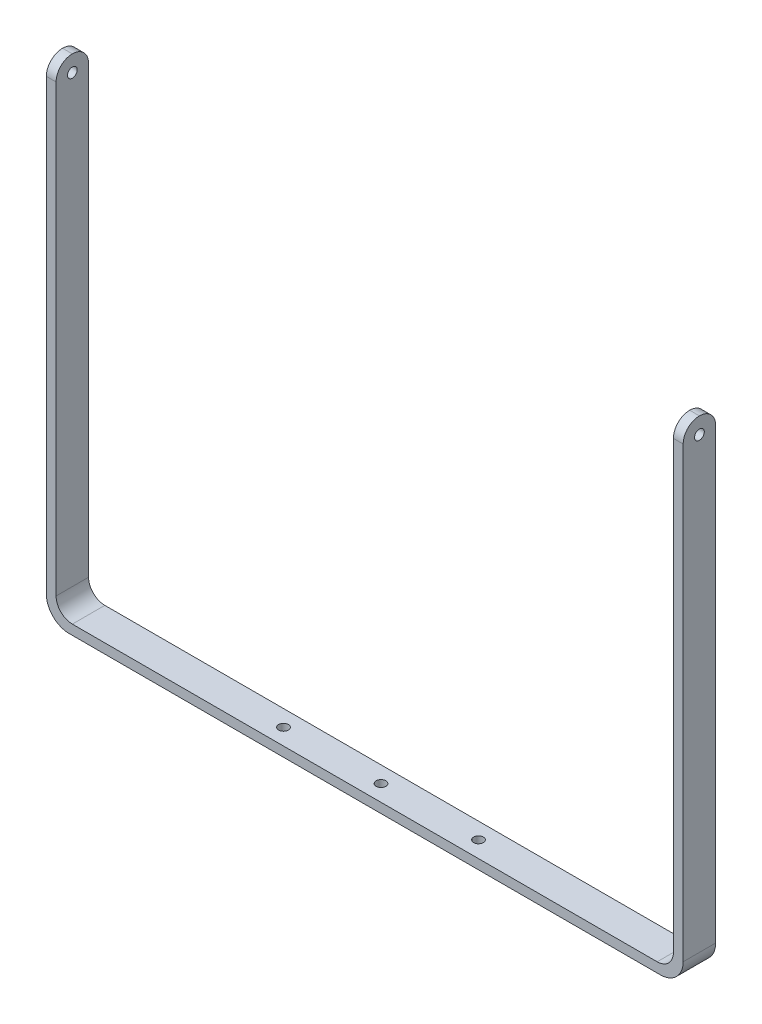
ISO-10303-21;
HEADER;
FILE_DESCRIPTION(('STEP AP214'),'2;1');
FILE_NAME('part.step','',(''),(''),'','','');
FILE_SCHEMA(('AUTOMOTIVE_DESIGN { 1 0 10303 214 1 1 1 1 }'));
ENDSEC;
DATA;
#1=APPLICATION_CONTEXT('core data for automotive mechanical design processes');
#2=APPLICATION_PROTOCOL_DEFINITION('international standard','automotive_design',2000,#1);
#3=PRODUCT_CONTEXT('',#1,'mechanical');
#4=PRODUCT('Part','Part','',(#3));
#5=PRODUCT_RELATED_PRODUCT_CATEGORY('part','',(#4));
#6=PRODUCT_DEFINITION_FORMATION('','',#4);
#7=PRODUCT_DEFINITION_CONTEXT('part definition',#1,'design');
#8=PRODUCT_DEFINITION('design','',#6,#7);
#9=PRODUCT_DEFINITION_SHAPE('','',#8);
#10=(LENGTH_UNIT() NAMED_UNIT(*) SI_UNIT(.MILLI.,.METRE.));
#11=(NAMED_UNIT(*) PLANE_ANGLE_UNIT() SI_UNIT($,.RADIAN.));
#12=(NAMED_UNIT(*) SI_UNIT($,.STERADIAN.) SOLID_ANGLE_UNIT());
#13=UNCERTAINTY_MEASURE_WITH_UNIT(LENGTH_MEASURE(1.E-05),#10,'distance_accuracy_value','');
#14=(GEOMETRIC_REPRESENTATION_CONTEXT(3) GLOBAL_UNCERTAINTY_ASSIGNED_CONTEXT((#13)) GLOBAL_UNIT_ASSIGNED_CONTEXT((#10,
#11,#12)) REPRESENTATION_CONTEXT('',''));
#15=CARTESIAN_POINT('',(0.,0.,0.));
#16=DIRECTION('',(0.,0.,1.));
#17=DIRECTION('',(1.,0.,0.));
#18=AXIS2_PLACEMENT_3D('',#15,#16,#17);
#19=CARTESIAN_POINT('',(-98.,75.,10.));
#20=DIRECTION('',(1.,0.,0.));
#21=DIRECTION('',(0.,0.,-1.));
#22=AXIS2_PLACEMENT_3D('',#19,#20,#21);
#23=PLANE('',#22);
#24=CARTESIAN_POINT('',(-98.,70.,5.));
#25=DIRECTION('',(-1.,0.,0.));
#26=DIRECTION('',(0.,0.,1.));
#27=AXIS2_PLACEMENT_3D('',#24,#25,#26);
#28=CIRCLE('',#27,1.5);
#29=CARTESIAN_POINT('',(-98.,70.,6.5));
#30=VERTEX_POINT('',#29);
#31=EDGE_CURVE('E484',#30,#30,#28,.T.);
#32=ORIENTED_EDGE('',*,*,#31,.F.);
#33=EDGE_LOOP('',(#32));
#34=FACE_BOUND('',#33,.T.);
#35=DIRECTION('',(0.,-1.,0.));
#36=VECTOR('',#35,1.);
#37=CARTESIAN_POINT('',(-98.,75.,0.));
#38=LINE('',#37,#36);
#39=CARTESIAN_POINT('',(-98.,70.,0.));
#40=VERTEX_POINT('',#39);
#41=CARTESIAN_POINT('',(-98.,-68.,0.));
#42=VERTEX_POINT('',#41);
#43=EDGE_CURVE('E200',#40,#42,#38,.T.);
#44=ORIENTED_EDGE('',*,*,#43,.T.);
#45=DIRECTION('',(0.,0.,-1.));
#46=VECTOR('',#45,1.);
#47=CARTESIAN_POINT('',(-98.,-68.,10.));
#48=LINE('',#47,#46);
#49=CARTESIAN_POINT('',(-98.,-68.,10.));
#50=VERTEX_POINT('',#49);
#51=EDGE_CURVE('E45',#42,#50,#48,.F.);
#52=ORIENTED_EDGE('',*,*,#51,.T.);
#53=DIRECTION('',(0.,-1.,0.));
#54=VECTOR('',#53,1.);
#55=CARTESIAN_POINT('',(-98.,75.,10.));
#56=LINE('',#55,#54);
#57=CARTESIAN_POINT('',(-98.,70.,10.));
#58=VERTEX_POINT('',#57);
#59=EDGE_CURVE('E254',#58,#50,#56,.T.);
#60=ORIENTED_EDGE('',*,*,#59,.F.);
#61=CARTESIAN_POINT('',(-98.,70.,5.));
#62=DIRECTION('',(1.,0.,0.));
#63=DIRECTION('',(0.,0.,-1.));
#64=AXIS2_PLACEMENT_3D('',#61,#62,#63);
#65=CIRCLE('',#64,5.);
#66=CARTESIAN_POINT('',(-98.,75.,5.));
#67=VERTEX_POINT('',#66);
#68=EDGE_CURVE('E182',#58,#67,#65,.F.);
#69=ORIENTED_EDGE('',*,*,#68,.T.);
#70=CARTESIAN_POINT('',(-98.,70.,5.));
#71=DIRECTION('',(1.,0.,0.));
#72=DIRECTION('',(0.,0.,-1.));
#73=AXIS2_PLACEMENT_3D('',#70,#71,#72);
#74=CIRCLE('',#73,5.);
#75=EDGE_CURVE('E184',#67,#40,#74,.F.);
#76=ORIENTED_EDGE('',*,*,#75,.T.);
#77=EDGE_LOOP('',(#44,#52,#60,#69,#76));
#78=FACE_BOUND('',#77,.T.);
#79=ADVANCED_FACE('F36',(#34,#78),#23,.F.);
#80=CARTESIAN_POINT('',(-98.,-75.,10.));
#81=DIRECTION('',(0.,1.,0.));
#82=DIRECTION('',(-1.,0.,0.));
#83=AXIS2_PLACEMENT_3D('',#80,#81,#82);
#84=PLANE('',#83);
#85=CARTESIAN_POINT('',(30.,-75.,5.));
#86=DIRECTION('',(0.,1.,0.));
#87=DIRECTION('',(-1.,0.,0.));
#88=AXIS2_PLACEMENT_3D('',#85,#86,#87);
#89=CIRCLE('',#88,1.5);
#90=CARTESIAN_POINT('',(28.5,-75.,5.));
#91=VERTEX_POINT('',#90);
#92=EDGE_CURVE('E483',#91,#91,#89,.T.);
#93=ORIENTED_EDGE('',*,*,#92,.T.);
#94=EDGE_LOOP('',(#93));
#95=FACE_BOUND('',#94,.T.);
#96=CARTESIAN_POINT('',(-30.,-75.,5.));
#97=DIRECTION('',(0.,1.,0.));
#98=DIRECTION('',(-1.,0.,0.));
#99=AXIS2_PLACEMENT_3D('',#96,#97,#98);
#100=CIRCLE('',#99,1.5);
#101=CARTESIAN_POINT('',(-31.5,-75.,5.));
#102=VERTEX_POINT('',#101);
#103=EDGE_CURVE('E485',#102,#102,#100,.T.);
#104=ORIENTED_EDGE('',*,*,#103,.T.);
#105=EDGE_LOOP('',(#104));
#106=FACE_BOUND('',#105,.T.);
#107=CARTESIAN_POINT('',(0.,-75.,5.));
#108=DIRECTION('',(0.,1.,0.));
#109=DIRECTION('',(-1.,0.,0.));
#110=AXIS2_PLACEMENT_3D('',#107,#108,#109);
#111=CIRCLE('',#110,1.5);
#112=CARTESIAN_POINT('',(-1.5,-75.,5.));
#113=VERTEX_POINT('',#112);
#114=EDGE_CURVE('E489',#113,#113,#111,.T.);
#115=ORIENTED_EDGE('',*,*,#114,.T.);
#116=EDGE_LOOP('',(#115));
#117=FACE_BOUND('',#116,.T.);
#118=DIRECTION('',(1.,0.,0.));
#119=VECTOR('',#118,1.);
#120=CARTESIAN_POINT('',(-98.,-75.,10.));
#121=LINE('',#120,#119);
#122=CARTESIAN_POINT('',(-91.,-75.,10.));
#123=VERTEX_POINT('',#122);
#124=CARTESIAN_POINT('',(91.,-75.0000000000001,10.));
#125=VERTEX_POINT('',#124);
#126=EDGE_CURVE('E151',#123,#125,#121,.T.);
#127=ORIENTED_EDGE('',*,*,#126,.F.);
#128=DIRECTION('',(0.,0.,-1.));
#129=VECTOR('',#128,1.);
#130=CARTESIAN_POINT('',(-91.,-75.,10.));
#131=LINE('',#130,#129);
#132=CARTESIAN_POINT('',(-91.,-75.,0.));
#133=VERTEX_POINT('',#132);
#134=EDGE_CURVE('E228',#123,#133,#131,.T.);
#135=ORIENTED_EDGE('',*,*,#134,.T.);
#136=DIRECTION('',(1.,0.,0.));
#137=VECTOR('',#136,1.);
#138=CARTESIAN_POINT('',(-98.,-75.,0.));
#139=LINE('',#138,#137);
#140=CARTESIAN_POINT('',(91.,-75.0000000000001,0.));
#141=VERTEX_POINT('',#140);
#142=EDGE_CURVE('E236',#133,#141,#139,.T.);
#143=ORIENTED_EDGE('',*,*,#142,.T.);
#144=DIRECTION('',(0.,0.,-1.));
#145=VECTOR('',#144,1.);
#146=CARTESIAN_POINT('',(91.,-75.0000000000001,10.));
#147=LINE('',#146,#145);
#148=EDGE_CURVE('E215',#141,#125,#147,.F.);
#149=ORIENTED_EDGE('',*,*,#148,.T.);
#150=EDGE_LOOP('',(#127,#135,#143,#149));
#151=FACE_BOUND('',#150,.T.);
#152=ADVANCED_FACE('F235',(#95,#106,#117,#151),#84,.F.);
#153=CARTESIAN_POINT('',(98.,75.0000000000001,10.));
#154=DIRECTION('',(-1.,0.,0.));
#155=DIRECTION('',(0.,0.,1.));
#156=AXIS2_PLACEMENT_3D('',#153,#154,#155);
#157=PLANE('',#156);
#158=CARTESIAN_POINT('',(98.,70.,5.));
#159=DIRECTION('',(-1.,0.,0.));
#160=DIRECTION('',(0.,0.,1.));
#161=AXIS2_PLACEMENT_3D('',#158,#159,#160);
#162=CIRCLE('',#161,1.5);
#163=CARTESIAN_POINT('',(98.,70.,6.5));
#164=VERTEX_POINT('',#163);
#165=EDGE_CURVE('E201',#164,#164,#162,.T.);
#166=ORIENTED_EDGE('',*,*,#165,.T.);
#167=EDGE_LOOP('',(#166));
#168=FACE_BOUND('',#167,.T.);
#169=DIRECTION('',(0.,1.,0.));
#170=VECTOR('',#169,1.);
#171=CARTESIAN_POINT('',(98.,75.0000000000001,10.));
#172=LINE('',#171,#170);
#173=CARTESIAN_POINT('',(98.,-68.,10.));
#174=VERTEX_POINT('',#173);
#175=CARTESIAN_POINT('',(98.,70.,10.));
#176=VERTEX_POINT('',#175);
#177=EDGE_CURVE('E138',#174,#176,#172,.T.);
#178=ORIENTED_EDGE('',*,*,#177,.F.);
#179=DIRECTION('',(0.,0.,-1.));
#180=VECTOR('',#179,1.);
#181=CARTESIAN_POINT('',(98.,-68.,10.));
#182=LINE('',#181,#180);
#183=CARTESIAN_POINT('',(98.,-68.,0.));
#184=VERTEX_POINT('',#183);
#185=EDGE_CURVE('E210',#174,#184,#182,.T.);
#186=ORIENTED_EDGE('',*,*,#185,.T.);
#187=DIRECTION('',(0.,1.,0.));
#188=VECTOR('',#187,1.);
#189=CARTESIAN_POINT('',(98.,75.0000000000001,0.));
#190=LINE('',#189,#188);
#191=CARTESIAN_POINT('',(98.,70.,0.));
#192=VERTEX_POINT('',#191);
#193=EDGE_CURVE('E242',#184,#192,#190,.T.);
#194=ORIENTED_EDGE('',*,*,#193,.T.);
#195=CARTESIAN_POINT('',(98.,70.,5.));
#196=DIRECTION('',(-1.,0.,0.));
#197=DIRECTION('',(0.,0.,1.));
#198=AXIS2_PLACEMENT_3D('',#195,#196,#197);
#199=CIRCLE('',#198,5.);
#200=CARTESIAN_POINT('',(98.,75.0000000000001,5.));
#201=VERTEX_POINT('',#200);
#202=EDGE_CURVE('E157',#192,#201,#199,.F.);
#203=ORIENTED_EDGE('',*,*,#202,.T.);
#204=CARTESIAN_POINT('',(98.,70.,5.));
#205=DIRECTION('',(-1.,0.,0.));
#206=DIRECTION('',(0.,0.,1.));
#207=AXIS2_PLACEMENT_3D('',#204,#205,#206);
#208=CIRCLE('',#207,5.);
#209=EDGE_CURVE('E154',#201,#176,#208,.F.);
#210=ORIENTED_EDGE('',*,*,#209,.T.);
#211=EDGE_LOOP('',(#178,#186,#194,#203,#210));
#212=FACE_BOUND('',#211,.T.);
#213=ADVANCED_FACE('F155',(#168,#212),#157,.F.);
#214=CARTESIAN_POINT('',(95.,-72.,10.));
#215=DIRECTION('',(1.,0.,0.));
#216=DIRECTION('',(0.,1.,0.));
#217=AXIS2_PLACEMENT_3D('',#214,#215,#216);
#218=PLANE('',#217);
#219=CARTESIAN_POINT('',(95.,70.,5.));
#220=DIRECTION('',(1.,0.,0.));
#221=DIRECTION('',(0.,1.,0.));
#222=AXIS2_PLACEMENT_3D('',#219,#220,#221);
#223=CIRCLE('',#222,1.5);
#224=CARTESIAN_POINT('',(95.,71.5,5.));
#225=VERTEX_POINT('',#224);
#226=EDGE_CURVE('E492',#225,#225,#223,.T.);
#227=ORIENTED_EDGE('',*,*,#226,.T.);
#228=EDGE_LOOP('',(#227));
#229=FACE_BOUND('',#228,.T.);
#230=DIRECTION('',(0.,-1.,0.));
#231=VECTOR('',#230,1.);
#232=CARTESIAN_POINT('',(95.,-72.,0.));
#233=LINE('',#232,#231);
#234=CARTESIAN_POINT('',(95.,70.,0.));
#235=VERTEX_POINT('',#234);
#236=CARTESIAN_POINT('',(95.,-67.,0.));
#237=VERTEX_POINT('',#236);
#238=EDGE_CURVE('E244',#235,#237,#233,.T.);
#239=ORIENTED_EDGE('',*,*,#238,.T.);
#240=DIRECTION('',(0.,0.,-1.));
#241=VECTOR('',#240,1.);
#242=CARTESIAN_POINT('',(95.,-67.,10.));
#243=LINE('',#242,#241);
#244=CARTESIAN_POINT('',(95.,-67.,10.));
#245=VERTEX_POINT('',#244);
#246=EDGE_CURVE('E204',#237,#245,#243,.F.);
#247=ORIENTED_EDGE('',*,*,#246,.T.);
#248=DIRECTION('',(0.,-1.,0.));
#249=VECTOR('',#248,1.);
#250=CARTESIAN_POINT('',(95.,-72.,10.));
#251=LINE('',#250,#249);
#252=CARTESIAN_POINT('',(95.,70.,10.));
#253=VERTEX_POINT('',#252);
#254=EDGE_CURVE('E150',#253,#245,#251,.T.);
#255=ORIENTED_EDGE('',*,*,#254,.F.);
#256=CARTESIAN_POINT('',(95.,70.,5.));
#257=DIRECTION('',(1.,0.,0.));
#258=DIRECTION('',(0.,1.,0.));
#259=AXIS2_PLACEMENT_3D('',#256,#257,#258);
#260=CIRCLE('',#259,5.);
#261=CARTESIAN_POINT('',(95.,75.,5.));
#262=VERTEX_POINT('',#261);
#263=EDGE_CURVE('E166',#253,#262,#260,.F.);
#264=ORIENTED_EDGE('',*,*,#263,.T.);
#265=CARTESIAN_POINT('',(95.,70.,5.));
#266=DIRECTION('',(1.,0.,0.));
#267=DIRECTION('',(0.,1.,0.));
#268=AXIS2_PLACEMENT_3D('',#265,#266,#267);
#269=CIRCLE('',#268,5.);
#270=EDGE_CURVE('E161',#262,#235,#269,.F.);
#271=ORIENTED_EDGE('',*,*,#270,.T.);
#272=EDGE_LOOP('',(#239,#247,#255,#264,#271));
#273=FACE_BOUND('',#272,.T.);
#274=ADVANCED_FACE('F291',(#229,#273),#218,.F.);
#275=CARTESIAN_POINT('',(-95.,-72.,10.));
#276=DIRECTION('',(0.,-1.,0.));
#277=DIRECTION('',(0.,0.,-1.));
#278=AXIS2_PLACEMENT_3D('',#275,#276,#277);
#279=PLANE('',#278);
#280=CARTESIAN_POINT('',(30.,-72.,5.));
#281=DIRECTION('',(0.,1.,0.));
#282=DIRECTION('',(-1.,0.,0.));
#283=AXIS2_PLACEMENT_3D('',#280,#281,#282);
#284=CIRCLE('',#283,1.5);
#285=CARTESIAN_POINT('',(28.5,-72.,5.));
#286=VERTEX_POINT('',#285);
#287=EDGE_CURVE('E480',#286,#286,#284,.T.);
#288=ORIENTED_EDGE('',*,*,#287,.F.);
#289=EDGE_LOOP('',(#288));
#290=FACE_BOUND('',#289,.T.);
#291=CARTESIAN_POINT('',(-30.,-72.,5.));
#292=DIRECTION('',(0.,1.,0.));
#293=DIRECTION('',(-1.,0.,0.));
#294=AXIS2_PLACEMENT_3D('',#291,#292,#293);
#295=CIRCLE('',#294,1.5);
#296=CARTESIAN_POINT('',(-31.5,-72.,5.));
#297=VERTEX_POINT('',#296);
#298=EDGE_CURVE('E505',#297,#297,#295,.T.);
#299=ORIENTED_EDGE('',*,*,#298,.F.);
#300=EDGE_LOOP('',(#299));
#301=FACE_BOUND('',#300,.T.);
#302=CARTESIAN_POINT('',(0.,-72.,5.));
#303=DIRECTION('',(0.,1.,0.));
#304=DIRECTION('',(-1.,0.,0.));
#305=AXIS2_PLACEMENT_3D('',#302,#303,#304);
#306=CIRCLE('',#305,1.5);
#307=CARTESIAN_POINT('',(-1.5,-72.,5.));
#308=VERTEX_POINT('',#307);
#309=EDGE_CURVE('E502',#308,#308,#306,.T.);
#310=ORIENTED_EDGE('',*,*,#309,.F.);
#311=EDGE_LOOP('',(#310));
#312=FACE_BOUND('',#311,.T.);
#313=DIRECTION('',(-1.,0.,0.));
#314=VECTOR('',#313,1.);
#315=CARTESIAN_POINT('',(-95.,-72.,0.));
#316=LINE('',#315,#314);
#317=CARTESIAN_POINT('',(90.,-72.,0.));
#318=VERTEX_POINT('',#317);
#319=CARTESIAN_POINT('',(-90.,-72.,0.));
#320=VERTEX_POINT('',#319);
#321=EDGE_CURVE('E249',#318,#320,#316,.T.);
#322=ORIENTED_EDGE('',*,*,#321,.T.);
#323=DIRECTION('',(0.,0.,-1.));
#324=VECTOR('',#323,1.);
#325=CARTESIAN_POINT('',(-90.,-72.,10.));
#326=LINE('',#325,#324);
#327=CARTESIAN_POINT('',(-90.,-72.,10.));
#328=VERTEX_POINT('',#327);
#329=EDGE_CURVE('E222',#320,#328,#326,.F.);
#330=ORIENTED_EDGE('',*,*,#329,.T.);
#331=DIRECTION('',(-1.,0.,0.));
#332=VECTOR('',#331,1.);
#333=CARTESIAN_POINT('',(-95.,-72.,10.));
#334=LINE('',#333,#332);
#335=CARTESIAN_POINT('',(90.,-72.,10.));
#336=VERTEX_POINT('',#335);
#337=EDGE_CURVE('E170',#336,#328,#334,.T.);
#338=ORIENTED_EDGE('',*,*,#337,.F.);
#339=DIRECTION('',(0.,0.,-1.));
#340=VECTOR('',#339,1.);
#341=CARTESIAN_POINT('',(90.,-72.,0.));
#342=LINE('',#341,#340);
#343=EDGE_CURVE('E196',#336,#318,#342,.T.);
#344=ORIENTED_EDGE('',*,*,#343,.T.);
#345=EDGE_LOOP('',(#322,#330,#338,#344));
#346=FACE_BOUND('',#345,.T.);
#347=ADVANCED_FACE('F295',(#290,#301,#312,#346),#279,.F.);
#348=CARTESIAN_POINT('',(-95.,75.,10.));
#349=DIRECTION('',(-1.,0.,0.));
#350=DIRECTION('',(0.,-1.,0.));
#351=AXIS2_PLACEMENT_3D('',#348,#349,#350);
#352=PLANE('',#351);
#353=CARTESIAN_POINT('',(-95.,70.,5.));
#354=DIRECTION('',(-1.,0.,0.));
#355=DIRECTION('',(0.,-1.,0.));
#356=AXIS2_PLACEMENT_3D('',#353,#354,#355);
#357=CIRCLE('',#356,1.5);
#358=CARTESIAN_POINT('',(-95.,68.5,5.));
#359=VERTEX_POINT('',#358);
#360=EDGE_CURVE('E40',#359,#359,#357,.T.);
#361=ORIENTED_EDGE('',*,*,#360,.T.);
#362=EDGE_LOOP('',(#361));
#363=FACE_BOUND('',#362,.T.);
#364=DIRECTION('',(0.,1.,0.));
#365=VECTOR('',#364,1.);
#366=CARTESIAN_POINT('',(-95.,75.,10.));
#367=LINE('',#366,#365);
#368=CARTESIAN_POINT('',(-95.,-66.9999999999999,10.));
#369=VERTEX_POINT('',#368);
#370=CARTESIAN_POINT('',(-95.,70.,10.));
#371=VERTEX_POINT('',#370);
#372=EDGE_CURVE('E167',#369,#371,#367,.T.);
#373=ORIENTED_EDGE('',*,*,#372,.F.);
#374=DIRECTION('',(0.,0.,-1.));
#375=VECTOR('',#374,1.);
#376=CARTESIAN_POINT('',(-95.,-67.,0.));
#377=LINE('',#376,#375);
#378=CARTESIAN_POINT('',(-95.,-66.9999999999999,0.));
#379=VERTEX_POINT('',#378);
#380=EDGE_CURVE('E219',#369,#379,#377,.T.);
#381=ORIENTED_EDGE('',*,*,#380,.T.);
#382=DIRECTION('',(0.,1.,0.));
#383=VECTOR('',#382,1.);
#384=CARTESIAN_POINT('',(-95.,75.,0.));
#385=LINE('',#384,#383);
#386=CARTESIAN_POINT('',(-95.,70.,0.));
#387=VERTEX_POINT('',#386);
#388=EDGE_CURVE('E173',#379,#387,#385,.T.);
#389=ORIENTED_EDGE('',*,*,#388,.T.);
#390=CARTESIAN_POINT('',(-95.,70.,5.));
#391=DIRECTION('',(-1.,0.,0.));
#392=DIRECTION('',(0.,-1.,0.));
#393=AXIS2_PLACEMENT_3D('',#390,#391,#392);
#394=CIRCLE('',#393,5.);
#395=CARTESIAN_POINT('',(-95.,75.,5.));
#396=VERTEX_POINT('',#395);
#397=EDGE_CURVE('E192',#387,#396,#394,.F.);
#398=ORIENTED_EDGE('',*,*,#397,.T.);
#399=CARTESIAN_POINT('',(-95.,70.,5.));
#400=DIRECTION('',(-1.,0.,0.));
#401=DIRECTION('',(0.,-1.,0.));
#402=AXIS2_PLACEMENT_3D('',#399,#400,#401);
#403=CIRCLE('',#402,5.);
#404=EDGE_CURVE('E189',#396,#371,#403,.F.);
#405=ORIENTED_EDGE('',*,*,#404,.T.);
#406=EDGE_LOOP('',(#373,#381,#389,#398,#405));
#407=FACE_BOUND('',#406,.T.);
#408=ADVANCED_FACE('F273',(#363,#407),#352,.F.);
#409=CARTESIAN_POINT('',(0.,0.,10.));
#410=DIRECTION('',(0.,0.,1.));
#411=DIRECTION('',(1.,0.,0.));
#412=AXIS2_PLACEMENT_3D('',#409,#410,#411);
#413=PLANE('',#412);
#414=ORIENTED_EDGE('',*,*,#59,.T.);
#415=CARTESIAN_POINT('',(-91.,-68.,10.));
#416=DIRECTION('',(0.,0.,1.));
#417=DIRECTION('',(1.,0.,0.));
#418=AXIS2_PLACEMENT_3D('',#415,#416,#417);
#419=CIRCLE('',#418,7.);
#420=EDGE_CURVE('E11',#50,#123,#419,.T.);
#421=ORIENTED_EDGE('',*,*,#420,.T.);
#422=ORIENTED_EDGE('',*,*,#126,.T.);
#423=CARTESIAN_POINT('',(91.,-68.,10.));
#424=DIRECTION('',(0.,0.,1.));
#425=DIRECTION('',(1.,0.,0.));
#426=AXIS2_PLACEMENT_3D('',#423,#424,#425);
#427=CIRCLE('',#426,7.);
#428=EDGE_CURVE('E146',#125,#174,#427,.T.);
#429=ORIENTED_EDGE('',*,*,#428,.T.);
#430=ORIENTED_EDGE('',*,*,#177,.T.);
#431=DIRECTION('',(-1.,0.,0.));
#432=VECTOR('',#431,1.);
#433=CARTESIAN_POINT('',(95.0000000000001,70.,10.));
#434=LINE('',#433,#432);
#435=EDGE_CURVE('E143',#176,#253,#434,.T.);
#436=ORIENTED_EDGE('',*,*,#435,.T.);
#437=ORIENTED_EDGE('',*,*,#254,.T.);
#438=CARTESIAN_POINT('',(90.,-67.,10.));
#439=DIRECTION('',(0.,0.,1.));
#440=DIRECTION('',(1.,0.,0.));
#441=AXIS2_PLACEMENT_3D('',#438,#439,#440);
#442=CIRCLE('',#441,5.);
#443=EDGE_CURVE('E208',#245,#336,#442,.F.);
#444=ORIENTED_EDGE('',*,*,#443,.T.);
#445=ORIENTED_EDGE('',*,*,#337,.T.);
#446=CARTESIAN_POINT('',(-90.,-67.,10.));
#447=DIRECTION('',(0.,0.,1.));
#448=DIRECTION('',(1.,0.,0.));
#449=AXIS2_PLACEMENT_3D('',#446,#447,#448);
#450=CIRCLE('',#449,5.);
#451=EDGE_CURVE('E226',#328,#369,#450,.F.);
#452=ORIENTED_EDGE('',*,*,#451,.T.);
#453=ORIENTED_EDGE('',*,*,#372,.T.);
#454=DIRECTION('',(-1.,0.,0.));
#455=VECTOR('',#454,1.);
#456=CARTESIAN_POINT('',(-98.,70.,10.));
#457=LINE('',#456,#455);
#458=EDGE_CURVE('E194',#371,#58,#457,.T.);
#459=ORIENTED_EDGE('',*,*,#458,.T.);
#460=EDGE_LOOP('',(#414,#421,#422,#429,#430,#436,#437,#444,#445,#452,#453,#459));
#461=FACE_BOUND('',#460,.T.);
#462=ADVANCED_FACE('F140',(#461),#413,.T.);
#463=CARTESIAN_POINT('',(0.,0.,0.));
#464=DIRECTION('',(0.,0.,1.));
#465=DIRECTION('',(1.,0.,0.));
#466=AXIS2_PLACEMENT_3D('',#463,#464,#465);
#467=PLANE('',#466);
#468=ORIENTED_EDGE('',*,*,#142,.F.);
#469=CARTESIAN_POINT('',(-91.,-68.,0.));
#470=DIRECTION('',(0.,0.,1.));
#471=DIRECTION('',(1.,0.,0.));
#472=AXIS2_PLACEMENT_3D('',#469,#470,#471);
#473=CIRCLE('',#472,7.);
#474=EDGE_CURVE('E59',#133,#42,#473,.F.);
#475=ORIENTED_EDGE('',*,*,#474,.T.);
#476=ORIENTED_EDGE('',*,*,#43,.F.);
#477=DIRECTION('',(-1.,0.,0.));
#478=VECTOR('',#477,1.);
#479=CARTESIAN_POINT('',(-3.23815048849006E-13,70.0000000000005,0.));
#480=LINE('',#479,#478);
#481=EDGE_CURVE('E186',#40,#387,#480,.F.);
#482=ORIENTED_EDGE('',*,*,#481,.T.);
#483=ORIENTED_EDGE('',*,*,#388,.F.);
#484=CARTESIAN_POINT('',(-90.,-67.,0.));
#485=DIRECTION('',(0.,0.,1.));
#486=DIRECTION('',(1.,0.,0.));
#487=AXIS2_PLACEMENT_3D('',#484,#485,#486);
#488=CIRCLE('',#487,5.);
#489=EDGE_CURVE('E224',#379,#320,#488,.T.);
#490=ORIENTED_EDGE('',*,*,#489,.T.);
#491=ORIENTED_EDGE('',*,*,#321,.F.);
#492=CARTESIAN_POINT('',(90.,-67.,0.));
#493=DIRECTION('',(0.,0.,1.));
#494=DIRECTION('',(1.,0.,0.));
#495=AXIS2_PLACEMENT_3D('',#492,#493,#494);
#496=CIRCLE('',#495,5.);
#497=EDGE_CURVE('E206',#318,#237,#496,.T.);
#498=ORIENTED_EDGE('',*,*,#497,.T.);
#499=ORIENTED_EDGE('',*,*,#238,.F.);
#500=DIRECTION('',(-1.,0.,0.));
#501=VECTOR('',#500,1.);
#502=CARTESIAN_POINT('',(-1.29526019539598E-12,69.9999999999982,0.));
#503=LINE('',#502,#501);
#504=EDGE_CURVE('E178',#235,#192,#503,.F.);
#505=ORIENTED_EDGE('',*,*,#504,.T.);
#506=ORIENTED_EDGE('',*,*,#193,.F.);
#507=CARTESIAN_POINT('',(91.,-68.,0.));
#508=DIRECTION('',(0.,0.,1.));
#509=DIRECTION('',(1.,0.,0.));
#510=AXIS2_PLACEMENT_3D('',#507,#508,#509);
#511=CIRCLE('',#510,7.);
#512=EDGE_CURVE('E212',#184,#141,#511,.F.);
#513=ORIENTED_EDGE('',*,*,#512,.T.);
#514=EDGE_LOOP('',(#468,#475,#476,#482,#483,#490,#491,#498,#499,#505,#506,#513));
#515=FACE_BOUND('',#514,.T.);
#516=ADVANCED_FACE('F239',(#515),#467,.F.);
#517=CARTESIAN_POINT('',(-1.29526019539598E-12,69.9999999999982,5.));
#518=DIRECTION('',(1.,0.,0.));
#519=DIRECTION('',(0.,1.,0.));
#520=AXIS2_PLACEMENT_3D('',#517,#518,#519);
#521=CYLINDRICAL_SURFACE('',#520,5.);
#522=ORIENTED_EDGE('',*,*,#209,.F.);
#523=DIRECTION('',(-1.,0.,0.));
#524=VECTOR('',#523,1.);
#525=CARTESIAN_POINT('',(98.,75.0000000000001,5.));
#526=LINE('',#525,#524);
#527=EDGE_CURVE('E162',#262,#201,#526,.F.);
#528=ORIENTED_EDGE('',*,*,#527,.F.);
#529=ORIENTED_EDGE('',*,*,#263,.F.);
#530=ORIENTED_EDGE('',*,*,#435,.F.);
#531=EDGE_LOOP('',(#522,#528,#529,#530));
#532=FACE_BOUND('',#531,.T.);
#533=ADVANCED_FACE('F164',(#532),#521,.T.);
#534=CARTESIAN_POINT('',(95.0000000000001,70.,5.));
#535=DIRECTION('',(-1.,0.,0.));
#536=DIRECTION('',(0.,-1.,0.));
#537=AXIS2_PLACEMENT_3D('',#534,#535,#536);
#538=CYLINDRICAL_SURFACE('',#537,5.);
#539=ORIENTED_EDGE('',*,*,#202,.F.);
#540=ORIENTED_EDGE('',*,*,#504,.F.);
#541=ORIENTED_EDGE('',*,*,#270,.F.);
#542=ORIENTED_EDGE('',*,*,#527,.T.);
#543=EDGE_LOOP('',(#539,#540,#541,#542));
#544=FACE_BOUND('',#543,.T.);
#545=ADVANCED_FACE('F289',(#544),#538,.T.);
#546=CARTESIAN_POINT('',(-3.23815048849006E-13,70.0000000000005,5.));
#547=DIRECTION('',(1.,0.,0.));
#548=DIRECTION('',(0.,1.,0.));
#549=AXIS2_PLACEMENT_3D('',#546,#547,#548);
#550=CYLINDRICAL_SURFACE('',#549,5.);
#551=ORIENTED_EDGE('',*,*,#458,.F.);
#552=ORIENTED_EDGE('',*,*,#404,.F.);
#553=DIRECTION('',(-1.,0.,0.));
#554=VECTOR('',#553,1.);
#555=CARTESIAN_POINT('',(-95.,75.,5.));
#556=LINE('',#555,#554);
#557=EDGE_CURVE('E197',#67,#396,#556,.F.);
#558=ORIENTED_EDGE('',*,*,#557,.F.);
#559=ORIENTED_EDGE('',*,*,#68,.F.);
#560=EDGE_LOOP('',(#551,#552,#558,#559));
#561=FACE_BOUND('',#560,.T.);
#562=ADVANCED_FACE('F282',(#561),#550,.T.);
#563=CARTESIAN_POINT('',(-98.,70.,5.));
#564=DIRECTION('',(-1.,0.,0.));
#565=DIRECTION('',(0.,-1.,0.));
#566=AXIS2_PLACEMENT_3D('',#563,#564,#565);
#567=CYLINDRICAL_SURFACE('',#566,5.);
#568=ORIENTED_EDGE('',*,*,#397,.F.);
#569=ORIENTED_EDGE('',*,*,#481,.F.);
#570=ORIENTED_EDGE('',*,*,#75,.F.);
#571=ORIENTED_EDGE('',*,*,#557,.T.);
#572=EDGE_LOOP('',(#568,#569,#570,#571));
#573=FACE_BOUND('',#572,.T.);
#574=ADVANCED_FACE('F277',(#573),#567,.T.);
#575=CARTESIAN_POINT('',(90.,-67.,10.));
#576=DIRECTION('',(0.,0.,1.));
#577=DIRECTION('',(1.,0.,0.));
#578=AXIS2_PLACEMENT_3D('',#575,#576,#577);
#579=CYLINDRICAL_SURFACE('',#578,5.);
#580=ORIENTED_EDGE('',*,*,#443,.F.);
#581=ORIENTED_EDGE('',*,*,#246,.F.);
#582=ORIENTED_EDGE('',*,*,#497,.F.);
#583=ORIENTED_EDGE('',*,*,#343,.F.);
#584=EDGE_LOOP('',(#580,#581,#582,#583));
#585=FACE_BOUND('',#584,.T.);
#586=ADVANCED_FACE('F294',(#585),#579,.F.);
#587=CARTESIAN_POINT('',(91.,-68.,10.));
#588=DIRECTION('',(0.,0.,-1.));
#589=DIRECTION('',(-1.,0.,0.));
#590=AXIS2_PLACEMENT_3D('',#587,#588,#589);
#591=CYLINDRICAL_SURFACE('',#590,7.);
#592=ORIENTED_EDGE('',*,*,#428,.F.);
#593=ORIENTED_EDGE('',*,*,#148,.F.);
#594=ORIENTED_EDGE('',*,*,#512,.F.);
#595=ORIENTED_EDGE('',*,*,#185,.F.);
#596=EDGE_LOOP('',(#592,#593,#594,#595));
#597=FACE_BOUND('',#596,.T.);
#598=ADVANCED_FACE('F285',(#597),#591,.T.);
#599=CARTESIAN_POINT('',(-90.,-67.,10.));
#600=DIRECTION('',(0.,0.,1.));
#601=DIRECTION('',(1.,0.,0.));
#602=AXIS2_PLACEMENT_3D('',#599,#600,#601);
#603=CYLINDRICAL_SURFACE('',#602,5.);
#604=ORIENTED_EDGE('',*,*,#451,.F.);
#605=ORIENTED_EDGE('',*,*,#329,.F.);
#606=ORIENTED_EDGE('',*,*,#489,.F.);
#607=ORIENTED_EDGE('',*,*,#380,.F.);
#608=EDGE_LOOP('',(#604,#605,#606,#607));
#609=FACE_BOUND('',#608,.T.);
#610=ADVANCED_FACE('F272',(#609),#603,.F.);
#611=CARTESIAN_POINT('',(-91.,-68.,10.));
#612=DIRECTION('',(0.,0.,-1.));
#613=DIRECTION('',(-1.,0.,0.));
#614=AXIS2_PLACEMENT_3D('',#611,#612,#613);
#615=CYLINDRICAL_SURFACE('',#614,7.);
#616=ORIENTED_EDGE('',*,*,#420,.F.);
#617=ORIENTED_EDGE('',*,*,#51,.F.);
#618=ORIENTED_EDGE('',*,*,#474,.F.);
#619=ORIENTED_EDGE('',*,*,#134,.F.);
#620=EDGE_LOOP('',(#616,#617,#618,#619));
#621=FACE_BOUND('',#620,.T.);
#622=ADVANCED_FACE('F38',(#621),#615,.T.);
#623=CARTESIAN_POINT('',(216.,70.,5.));
#624=DIRECTION('',(-1.,0.,0.));
#625=DIRECTION('',(0.,0.,1.));
#626=AXIS2_PLACEMENT_3D('',#623,#624,#625);
#627=CYLINDRICAL_SURFACE('',#626,1.5);
#628=ORIENTED_EDGE('',*,*,#31,.T.);
#629=EDGE_LOOP('',(#628));
#630=FACE_BOUND('',#629,.T.);
#631=ORIENTED_EDGE('',*,*,#360,.F.);
#632=EDGE_LOOP('',(#631));
#633=FACE_BOUND('',#632,.T.);
#634=ADVANCED_FACE('F335',(#630,#633),#627,.F.);
#635=ORIENTED_EDGE('',*,*,#226,.F.);
#636=EDGE_LOOP('',(#635));
#637=FACE_BOUND('',#636,.T.);
#638=ORIENTED_EDGE('',*,*,#165,.F.);
#639=EDGE_LOOP('',(#638));
#640=FACE_BOUND('',#639,.T.);
#641=ADVANCED_FACE('F339',(#637,#640),#627,.F.);
#642=CARTESIAN_POINT('',(0.,-83.,5.));
#643=DIRECTION('',(0.,1.,0.));
#644=DIRECTION('',(-1.,0.,0.));
#645=AXIS2_PLACEMENT_3D('',#642,#643,#644);
#646=CYLINDRICAL_SURFACE('',#645,1.5);
#647=ORIENTED_EDGE('',*,*,#309,.T.);
#648=EDGE_LOOP('',(#647));
#649=FACE_BOUND('',#648,.T.);
#650=ORIENTED_EDGE('',*,*,#114,.F.);
#651=EDGE_LOOP('',(#650));
#652=FACE_BOUND('',#651,.T.);
#653=ADVANCED_FACE('F345',(#649,#652),#646,.F.);
#654=CARTESIAN_POINT('',(-30.,-83.,5.));
#655=DIRECTION('',(0.,1.,0.));
#656=DIRECTION('',(-1.,0.,0.));
#657=AXIS2_PLACEMENT_3D('',#654,#655,#656);
#658=CYLINDRICAL_SURFACE('',#657,1.5);
#659=ORIENTED_EDGE('',*,*,#298,.T.);
#660=EDGE_LOOP('',(#659));
#661=FACE_BOUND('',#660,.T.);
#662=ORIENTED_EDGE('',*,*,#103,.F.);
#663=EDGE_LOOP('',(#662));
#664=FACE_BOUND('',#663,.T.);
#665=ADVANCED_FACE('F456',(#661,#664),#658,.F.);
#666=CARTESIAN_POINT('',(30.,-83.,5.));
#667=DIRECTION('',(0.,1.,0.));
#668=DIRECTION('',(-1.,0.,0.));
#669=AXIS2_PLACEMENT_3D('',#666,#667,#668);
#670=CYLINDRICAL_SURFACE('',#669,1.5);
#671=ORIENTED_EDGE('',*,*,#287,.T.);
#672=EDGE_LOOP('',(#671));
#673=FACE_BOUND('',#672,.T.);
#674=ORIENTED_EDGE('',*,*,#92,.F.);
#675=EDGE_LOOP('',(#674));
#676=FACE_BOUND('',#675,.T.);
#677=ADVANCED_FACE('F464',(#673,#676),#670,.F.);
#678=CLOSED_SHELL('',(#79,#152,#213,#274,#347,#408,#462,#516,#533,#545,#562,#574,#586,#598,#610,
#622,#634,#641,#653,#665,#677));
#679=MANIFOLD_SOLID_BREP('B2',#678);
#680=ADVANCED_BREP_SHAPE_REPRESENTATION('',(#18,#679),#14);
#681=SHAPE_DEFINITION_REPRESENTATION(#9,#680);
ENDSEC;
END-ISO-10303-21;
